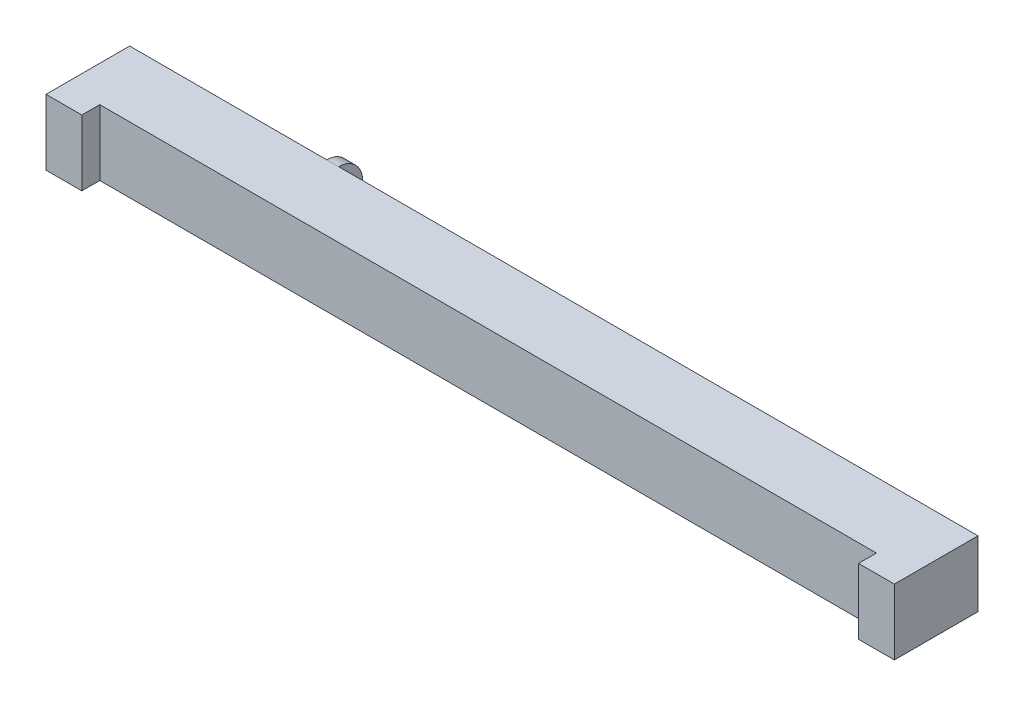
ISO-10303-21;
HEADER;
FILE_DESCRIPTION(('STEP AP214'),'2;1');
FILE_NAME('part.step','',(''),(''),'','','');
FILE_SCHEMA(('AUTOMOTIVE_DESIGN { 1 0 10303 214 1 1 1 1 }'));
ENDSEC;
DATA;
#1=APPLICATION_CONTEXT('core data for automotive mechanical design processes');
#2=APPLICATION_PROTOCOL_DEFINITION('international standard','automotive_design',2000,#1);
#3=PRODUCT_CONTEXT('',#1,'mechanical');
#4=PRODUCT('Part','Part','',(#3));
#5=PRODUCT_RELATED_PRODUCT_CATEGORY('part','',(#4));
#6=PRODUCT_DEFINITION_FORMATION('','',#4);
#7=PRODUCT_DEFINITION_CONTEXT('part definition',#1,'design');
#8=PRODUCT_DEFINITION('design','',#6,#7);
#9=PRODUCT_DEFINITION_SHAPE('','',#8);
#10=(LENGTH_UNIT() NAMED_UNIT(*) SI_UNIT(.MILLI.,.METRE.));
#11=(NAMED_UNIT(*) PLANE_ANGLE_UNIT() SI_UNIT($,.RADIAN.));
#12=(NAMED_UNIT(*) SI_UNIT($,.STERADIAN.) SOLID_ANGLE_UNIT());
#13=UNCERTAINTY_MEASURE_WITH_UNIT(LENGTH_MEASURE(1.E-05),#10,'distance_accuracy_value','');
#14=(GEOMETRIC_REPRESENTATION_CONTEXT(3) GLOBAL_UNCERTAINTY_ASSIGNED_CONTEXT((#13)) GLOBAL_UNIT_ASSIGNED_CONTEXT((#10,
#11,#12)) REPRESENTATION_CONTEXT('',''));
#15=CARTESIAN_POINT('',(0.,0.,0.));
#16=DIRECTION('',(0.,0.,1.));
#17=DIRECTION('',(1.,0.,0.));
#18=AXIS2_PLACEMENT_3D('',#15,#16,#17);
#19=CARTESIAN_POINT('',(-31.5,-63.0317380372777,-3.5));
#20=DIRECTION('',(-1.,0.,0.));
#21=DIRECTION('',(0.,0.,1.));
#22=AXIS2_PLACEMENT_3D('',#19,#20,#21);
#23=PLANE('',#22);
#24=DIRECTION('',(0.,1.,0.));
#25=VECTOR('',#24,1.);
#26=CARTESIAN_POINT('',(-31.5,-63.0317380372777,-3.5));
#27=LINE('',#26,#25);
#28=CARTESIAN_POINT('',(-31.5,0.,-3.5));
#29=VERTEX_POINT('',#28);
#30=CARTESIAN_POINT('',(-31.5,2.6,-3.5));
#31=VERTEX_POINT('',#30);
#32=EDGE_CURVE('E305',#29,#31,#27,.T.);
#33=ORIENTED_EDGE('',*,*,#32,.T.);
#34=DIRECTION('',(0.,0.,1.));
#35=VECTOR('',#34,1.);
#36=CARTESIAN_POINT('',(-31.5,2.6,-5.5));
#37=LINE('',#36,#35);
#38=CARTESIAN_POINT('',(-31.5,2.6,-5.5));
#39=VERTEX_POINT('',#38);
#40=EDGE_CURVE('E257',#39,#31,#37,.T.);
#41=ORIENTED_EDGE('',*,*,#40,.F.);
#42=DIRECTION('',(0.,1.,0.));
#43=VECTOR('',#42,1.);
#44=CARTESIAN_POINT('',(-31.5,-63.0317380372777,-5.5));
#45=LINE('',#44,#43);
#46=CARTESIAN_POINT('',(-31.5,0.,-5.5));
#47=VERTEX_POINT('',#46);
#48=EDGE_CURVE('E428',#47,#39,#45,.T.);
#49=ORIENTED_EDGE('',*,*,#48,.F.);
#50=DIRECTION('',(0.,0.,-1.));
#51=VECTOR('',#50,1.);
#52=CARTESIAN_POINT('',(-31.5,0.,-3.5));
#53=LINE('',#52,#51);
#54=EDGE_CURVE('E304',#29,#47,#53,.T.);
#55=ORIENTED_EDGE('',*,*,#54,.F.);
#56=EDGE_LOOP('',(#33,#41,#49,#55));
#57=FACE_BOUND('',#56,.T.);
#58=ADVANCED_FACE('F35',(#57),#23,.T.);
#59=CARTESIAN_POINT('',(-35.5,5.5,-3.5));
#60=DIRECTION('',(0.,0.,1.));
#61=DIRECTION('',(1.,0.,0.));
#62=AXIS2_PLACEMENT_3D('',#59,#60,#61);
#63=PLANE('',#62);
#64=DIRECTION('',(0.,1.,0.));
#65=VECTOR('',#64,1.);
#66=CARTESIAN_POINT('',(-34.670728733258,4.93410987982223,-3.5));
#67=LINE('',#66,#65);
#68=CARTESIAN_POINT('',(-34.670728733258,3.13346972287778,-3.5));
#69=VERTEX_POINT('',#68);
#70=CARTESIAN_POINT('',(-34.670728733258,4.93410987982223,-3.5));
#71=VERTEX_POINT('',#70);
#72=EDGE_CURVE('E232',#69,#71,#67,.T.);
#73=ORIENTED_EDGE('',*,*,#72,.F.);
#74=DIRECTION('',(-1.,0.,0.));
#75=VECTOR('',#74,1.);
#76=CARTESIAN_POINT('',(-34.670728733258,3.13346972287778,-3.5));
#77=LINE('',#76,#75);
#78=CARTESIAN_POINT('',(-19.,3.13346972287778,-3.5));
#79=VERTEX_POINT('',#78);
#80=EDGE_CURVE('E240',#79,#69,#77,.T.);
#81=ORIENTED_EDGE('',*,*,#80,.F.);
#82=DIRECTION('',(0.,1.,0.));
#83=VECTOR('',#82,1.);
#84=CARTESIAN_POINT('',(-19.,2.6,-3.5));
#85=LINE('',#84,#83);
#86=CARTESIAN_POINT('',(-19.,2.6,-3.5));
#87=VERTEX_POINT('',#86);
#88=EDGE_CURVE('E277',#87,#79,#85,.T.);
#89=ORIENTED_EDGE('',*,*,#88,.F.);
#90=DIRECTION('',(1.,0.,0.));
#91=VECTOR('',#90,1.);
#92=CARTESIAN_POINT('',(-31.5,2.6,-3.5));
#93=LINE('',#92,#91);
#94=EDGE_CURVE('E265',#31,#87,#93,.T.);
#95=ORIENTED_EDGE('',*,*,#94,.F.);
#96=ORIENTED_EDGE('',*,*,#32,.F.);
#97=DIRECTION('',(-1.,0.,0.));
#98=VECTOR('',#97,1.);
#99=CARTESIAN_POINT('',(-35.5,0.,-3.5));
#100=LINE('',#99,#98);
#101=CARTESIAN_POINT('',(-35.5,0.,-3.5));
#102=VERTEX_POINT('',#101);
#103=EDGE_CURVE('E363',#29,#102,#100,.T.);
#104=ORIENTED_EDGE('',*,*,#103,.T.);
#105=DIRECTION('',(0.,-1.,0.));
#106=VECTOR('',#105,1.);
#107=CARTESIAN_POINT('',(-35.5,5.5,-3.5));
#108=LINE('',#107,#106);
#109=CARTESIAN_POINT('',(-35.5,5.5,-3.5));
#110=VERTEX_POINT('',#109);
#111=EDGE_CURVE('E338',#110,#102,#108,.T.);
#112=ORIENTED_EDGE('',*,*,#111,.F.);
#113=DIRECTION('',(-1.,0.,0.));
#114=VECTOR('',#113,1.);
#115=CARTESIAN_POINT('',(-35.5,5.5,-3.5));
#116=LINE('',#115,#114);
#117=CARTESIAN_POINT('',(-19.,5.5,-3.5));
#118=VERTEX_POINT('',#117);
#119=EDGE_CURVE('E329',#118,#110,#116,.T.);
#120=ORIENTED_EDGE('',*,*,#119,.F.);
#121=CARTESIAN_POINT('',(-19.,4.93410987982222,-3.5));
#122=VERTEX_POINT('',#121);
#123=EDGE_CURVE('E272',#122,#118,#85,.T.);
#124=ORIENTED_EDGE('',*,*,#123,.F.);
#125=DIRECTION('',(1.,0.,0.));
#126=VECTOR('',#125,1.);
#127=CARTESIAN_POINT('',(-34.670728733258,4.93410987982223,-3.5));
#128=LINE('',#127,#126);
#129=EDGE_CURVE('E58',#71,#122,#128,.T.);
#130=ORIENTED_EDGE('',*,*,#129,.F.);
#131=EDGE_LOOP('',(#73,#81,#89,#95,#96,#104,#112,#120,#124,#130));
#132=FACE_BOUND('',#131,.T.);
#133=ADVANCED_FACE('F336',(#132),#63,.F.);
#134=CARTESIAN_POINT('',(-35.5,5.5,3.5));
#135=DIRECTION('',(0.,0.,-1.));
#136=DIRECTION('',(-1.,0.,0.));
#137=AXIS2_PLACEMENT_3D('',#134,#135,#136);
#138=PLANE('',#137);
#139=DIRECTION('',(1.,0.,0.));
#140=VECTOR('',#139,1.);
#141=CARTESIAN_POINT('',(-35.5,5.5,3.5));
#142=LINE('',#141,#140);
#143=CARTESIAN_POINT('',(32.5,5.5,3.5));
#144=VERTEX_POINT('',#143);
#145=CARTESIAN_POINT('',(35.5,5.5,3.5));
#146=VERTEX_POINT('',#145);
#147=EDGE_CURVE('E406',#144,#146,#142,.T.);
#148=ORIENTED_EDGE('',*,*,#147,.F.);
#149=DIRECTION('',(0.,-1.,0.));
#150=VECTOR('',#149,1.);
#151=CARTESIAN_POINT('',(32.5,5.5,3.5));
#152=LINE('',#151,#150);
#153=CARTESIAN_POINT('',(32.5,0.,3.5));
#154=VERTEX_POINT('',#153);
#155=EDGE_CURVE('E357',#144,#154,#152,.T.);
#156=ORIENTED_EDGE('',*,*,#155,.T.);
#157=DIRECTION('',(1.,0.,0.));
#158=VECTOR('',#157,1.);
#159=CARTESIAN_POINT('',(-35.5,0.,3.5));
#160=LINE('',#159,#158);
#161=CARTESIAN_POINT('',(35.5,0.,3.5));
#162=VERTEX_POINT('',#161);
#163=EDGE_CURVE('E356',#154,#162,#160,.T.);
#164=ORIENTED_EDGE('',*,*,#163,.T.);
#165=DIRECTION('',(0.,-1.,0.));
#166=VECTOR('',#165,1.);
#167=CARTESIAN_POINT('',(35.5,5.5,3.5));
#168=LINE('',#167,#166);
#169=EDGE_CURVE('E383',#146,#162,#168,.T.);
#170=ORIENTED_EDGE('',*,*,#169,.F.);
#171=EDGE_LOOP('',(#148,#156,#164,#170));
#172=FACE_BOUND('',#171,.T.);
#173=ADVANCED_FACE('F466',(#172),#138,.F.);
#174=CARTESIAN_POINT('',(-35.5,5.5,-3.5));
#175=DIRECTION('',(1.,0.,0.));
#176=DIRECTION('',(0.,0.,-1.));
#177=AXIS2_PLACEMENT_3D('',#174,#175,#176);
#178=PLANE('',#177);
#179=DIRECTION('',(0.,0.,1.));
#180=VECTOR('',#179,1.);
#181=CARTESIAN_POINT('',(-35.5,0.,-3.5));
#182=LINE('',#181,#180);
#183=CARTESIAN_POINT('',(-35.5,0.,3.5));
#184=VERTEX_POINT('',#183);
#185=EDGE_CURVE('E352',#102,#184,#182,.T.);
#186=ORIENTED_EDGE('',*,*,#185,.T.);
#187=DIRECTION('',(0.,-1.,0.));
#188=VECTOR('',#187,1.);
#189=CARTESIAN_POINT('',(-35.5,5.5,3.5));
#190=LINE('',#189,#188);
#191=CARTESIAN_POINT('',(-35.5,5.5,3.5));
#192=VERTEX_POINT('',#191);
#193=EDGE_CURVE('E380',#192,#184,#190,.T.);
#194=ORIENTED_EDGE('',*,*,#193,.F.);
#195=DIRECTION('',(0.,0.,1.));
#196=VECTOR('',#195,1.);
#197=CARTESIAN_POINT('',(-35.5,5.5,-3.5));
#198=LINE('',#197,#196);
#199=EDGE_CURVE('E371',#110,#192,#198,.T.);
#200=ORIENTED_EDGE('',*,*,#199,.F.);
#201=ORIENTED_EDGE('',*,*,#111,.T.);
#202=EDGE_LOOP('',(#186,#194,#200,#201));
#203=FACE_BOUND('',#202,.T.);
#204=ADVANCED_FACE('F392',(#203),#178,.F.);
#205=CARTESIAN_POINT('',(-32.5,0.,3.5));
#206=VERTEX_POINT('',#205);
#207=EDGE_CURVE('E358',#184,#206,#160,.T.);
#208=ORIENTED_EDGE('',*,*,#207,.T.);
#209=DIRECTION('',(0.,1.,0.));
#210=VECTOR('',#209,1.);
#211=CARTESIAN_POINT('',(-32.5,5.5,3.5));
#212=LINE('',#211,#210);
#213=CARTESIAN_POINT('',(-32.5,5.5,3.5));
#214=VERTEX_POINT('',#213);
#215=EDGE_CURVE('E404',#206,#214,#212,.T.);
#216=ORIENTED_EDGE('',*,*,#215,.T.);
#217=EDGE_CURVE('E343',#192,#214,#142,.T.);
#218=ORIENTED_EDGE('',*,*,#217,.F.);
#219=ORIENTED_EDGE('',*,*,#193,.T.);
#220=EDGE_LOOP('',(#208,#216,#218,#219));
#221=FACE_BOUND('',#220,.T.);
#222=ADVANCED_FACE('F402',(#221),#138,.F.);
#223=CARTESIAN_POINT('',(35.5,5.5,-3.5));
#224=DIRECTION('',(-1.,0.,0.));
#225=DIRECTION('',(0.,0.,1.));
#226=AXIS2_PLACEMENT_3D('',#223,#224,#225);
#227=PLANE('',#226);
#228=DIRECTION('',(0.,0.,-1.));
#229=VECTOR('',#228,1.);
#230=CARTESIAN_POINT('',(35.5,0.,-3.5));
#231=LINE('',#230,#229);
#232=CARTESIAN_POINT('',(35.5,0.,-3.5));
#233=VERTEX_POINT('',#232);
#234=EDGE_CURVE('E361',#162,#233,#231,.T.);
#235=ORIENTED_EDGE('',*,*,#234,.T.);
#236=DIRECTION('',(0.,-1.,0.));
#237=VECTOR('',#236,1.);
#238=CARTESIAN_POINT('',(35.5,5.5,-3.5));
#239=LINE('',#238,#237);
#240=CARTESIAN_POINT('',(35.5,5.5,-3.5));
#241=VERTEX_POINT('',#240);
#242=EDGE_CURVE('E385',#241,#233,#239,.T.);
#243=ORIENTED_EDGE('',*,*,#242,.F.);
#244=DIRECTION('',(0.,0.,-1.));
#245=VECTOR('',#244,1.);
#246=CARTESIAN_POINT('',(35.5,5.5,-3.5));
#247=LINE('',#246,#245);
#248=EDGE_CURVE('E340',#146,#241,#247,.T.);
#249=ORIENTED_EDGE('',*,*,#248,.F.);
#250=ORIENTED_EDGE('',*,*,#169,.T.);
#251=EDGE_LOOP('',(#235,#243,#249,#250));
#252=FACE_BOUND('',#251,.T.);
#253=ADVANCED_FACE('F495',(#252),#227,.F.);
#254=DIRECTION('',(0.,1.,0.));
#255=VECTOR('',#254,1.);
#256=CARTESIAN_POINT('',(-18.,2.6,-3.5));
#257=LINE('',#256,#255);
#258=CARTESIAN_POINT('',(-18.,2.6,-3.5));
#259=VERTEX_POINT('',#258);
#260=CARTESIAN_POINT('',(-18.,3.13346972287778,-3.5));
#261=VERTEX_POINT('',#260);
#262=EDGE_CURVE('E290',#259,#261,#257,.T.);
#263=ORIENTED_EDGE('',*,*,#262,.T.);
#264=DIRECTION('',(-1.,0.,0.));
#265=VECTOR('',#264,1.);
#266=CARTESIAN_POINT('',(-18.,3.13346972287778,-3.5));
#267=LINE('',#266,#265);
#268=CARTESIAN_POINT('',(34.747146170088,3.13346972287778,-3.5));
#269=VERTEX_POINT('',#268);
#270=EDGE_CURVE('E50',#269,#261,#267,.T.);
#271=ORIENTED_EDGE('',*,*,#270,.F.);
#272=DIRECTION('',(0.,-1.,0.));
#273=VECTOR('',#272,1.);
#274=CARTESIAN_POINT('',(34.747146170088,4.93410987982223,-3.5));
#275=LINE('',#274,#273);
#276=CARTESIAN_POINT('',(34.747146170088,4.93410987982223,-3.5));
#277=VERTEX_POINT('',#276);
#278=EDGE_CURVE('E221',#277,#269,#275,.T.);
#279=ORIENTED_EDGE('',*,*,#278,.F.);
#280=DIRECTION('',(1.,0.,0.));
#281=VECTOR('',#280,1.);
#282=CARTESIAN_POINT('',(-18.,4.93410987982223,-3.5));
#283=LINE('',#282,#281);
#284=CARTESIAN_POINT('',(-18.,4.93410987982223,-3.5));
#285=VERTEX_POINT('',#284);
#286=EDGE_CURVE('E226',#285,#277,#283,.T.);
#287=ORIENTED_EDGE('',*,*,#286,.F.);
#288=CARTESIAN_POINT('',(-18.,5.5,-3.5));
#289=VERTEX_POINT('',#288);
#290=EDGE_CURVE('E203',#285,#289,#257,.T.);
#291=ORIENTED_EDGE('',*,*,#290,.T.);
#292=EDGE_CURVE('E332',#241,#289,#116,.T.);
#293=ORIENTED_EDGE('',*,*,#292,.F.);
#294=ORIENTED_EDGE('',*,*,#242,.T.);
#295=CARTESIAN_POINT('',(31.5,0.,-3.5));
#296=VERTEX_POINT('',#295);
#297=EDGE_CURVE('E369',#233,#296,#100,.T.);
#298=ORIENTED_EDGE('',*,*,#297,.T.);
#299=DIRECTION('',(0.,1.,0.));
#300=VECTOR('',#299,1.);
#301=CARTESIAN_POINT('',(31.5,-63.0317380372777,-3.5));
#302=LINE('',#301,#300);
#303=CARTESIAN_POINT('',(31.5,2.6,-3.5));
#304=VERTEX_POINT('',#303);
#305=EDGE_CURVE('E300',#296,#304,#302,.T.);
#306=ORIENTED_EDGE('',*,*,#305,.T.);
#307=DIRECTION('',(1.,0.,0.));
#308=VECTOR('',#307,1.);
#309=CARTESIAN_POINT('',(31.5,2.6,-3.5));
#310=LINE('',#309,#308);
#311=EDGE_CURVE('E287',#259,#304,#310,.T.);
#312=ORIENTED_EDGE('',*,*,#311,.F.);
#313=EDGE_LOOP('',(#263,#271,#279,#287,#291,#293,#294,#298,#306,#312));
#314=FACE_BOUND('',#313,.T.);
#315=ADVANCED_FACE('F468',(#314),#63,.F.);
#316=CARTESIAN_POINT('',(-35.5,5.5,3.5));
#317=DIRECTION('',(0.,1.,0.));
#318=DIRECTION('',(0.,0.,1.));
#319=AXIS2_PLACEMENT_3D('',#316,#317,#318);
#320=PLANE('',#319);
#321=ORIENTED_EDGE('',*,*,#292,.T.);
#322=DIRECTION('',(-1.,0.,0.));
#323=VECTOR('',#322,1.);
#324=CARTESIAN_POINT('',(-35.5,5.5,-3.5));
#325=LINE('',#324,#323);
#326=EDGE_CURVE('E308',#289,#118,#325,.T.);
#327=ORIENTED_EDGE('',*,*,#326,.T.);
#328=ORIENTED_EDGE('',*,*,#119,.T.);
#329=ORIENTED_EDGE('',*,*,#199,.T.);
#330=ORIENTED_EDGE('',*,*,#217,.T.);
#331=DIRECTION('',(0.,0.,1.));
#332=VECTOR('',#331,1.);
#333=CARTESIAN_POINT('',(-32.5,5.5,4.76632018269155));
#334=LINE('',#333,#332);
#335=CARTESIAN_POINT('',(-32.5,5.5,2.));
#336=VERTEX_POINT('',#335);
#337=EDGE_CURVE('E416',#336,#214,#334,.T.);
#338=ORIENTED_EDGE('',*,*,#337,.F.);
#339=DIRECTION('',(-1.,0.,0.));
#340=VECTOR('',#339,1.);
#341=CARTESIAN_POINT('',(32.5,5.5,2.));
#342=LINE('',#341,#340);
#343=CARTESIAN_POINT('',(32.5,5.5,2.));
#344=VERTEX_POINT('',#343);
#345=EDGE_CURVE('E419',#344,#336,#342,.T.);
#346=ORIENTED_EDGE('',*,*,#345,.F.);
#347=DIRECTION('',(0.,0.,-1.));
#348=VECTOR('',#347,1.);
#349=CARTESIAN_POINT('',(32.5,5.5,4.76632018269155));
#350=LINE('',#349,#348);
#351=EDGE_CURVE('E422',#144,#344,#350,.T.);
#352=ORIENTED_EDGE('',*,*,#351,.F.);
#353=ORIENTED_EDGE('',*,*,#147,.T.);
#354=ORIENTED_EDGE('',*,*,#248,.T.);
#355=EDGE_LOOP('',(#321,#327,#328,#329,#330,#338,#346,#352,#353,#354));
#356=FACE_BOUND('',#355,.T.);
#357=ADVANCED_FACE('F327',(#356),#320,.T.);
#358=CARTESIAN_POINT('',(-35.5,0.,3.5));
#359=DIRECTION('',(0.,1.,0.));
#360=DIRECTION('',(0.,0.,1.));
#361=AXIS2_PLACEMENT_3D('',#358,#359,#360);
#362=PLANE('',#361);
#363=ORIENTED_EDGE('',*,*,#163,.F.);
#364=DIRECTION('',(0.,0.,-1.));
#365=VECTOR('',#364,1.);
#366=CARTESIAN_POINT('',(32.5,0.,3.5));
#367=LINE('',#366,#365);
#368=CARTESIAN_POINT('',(32.5,0.,2.));
#369=VERTEX_POINT('',#368);
#370=EDGE_CURVE('E312',#154,#369,#367,.T.);
#371=ORIENTED_EDGE('',*,*,#370,.T.);
#372=DIRECTION('',(-1.,0.,0.));
#373=VECTOR('',#372,1.);
#374=CARTESIAN_POINT('',(-35.5,0.,2.));
#375=LINE('',#374,#373);
#376=CARTESIAN_POINT('',(-32.5,0.,2.));
#377=VERTEX_POINT('',#376);
#378=EDGE_CURVE('E377',#369,#377,#375,.T.);
#379=ORIENTED_EDGE('',*,*,#378,.T.);
#380=DIRECTION('',(0.,0.,1.));
#381=VECTOR('',#380,1.);
#382=CARTESIAN_POINT('',(-32.5,0.,3.5));
#383=LINE('',#382,#381);
#384=EDGE_CURVE('E374',#377,#206,#383,.T.);
#385=ORIENTED_EDGE('',*,*,#384,.T.);
#386=ORIENTED_EDGE('',*,*,#207,.F.);
#387=ORIENTED_EDGE('',*,*,#185,.F.);
#388=ORIENTED_EDGE('',*,*,#103,.F.);
#389=ORIENTED_EDGE('',*,*,#54,.T.);
#390=DIRECTION('',(1.,0.,0.));
#391=VECTOR('',#390,1.);
#392=CARTESIAN_POINT('',(31.5,0.,-5.5));
#393=LINE('',#392,#391);
#394=CARTESIAN_POINT('',(31.5,0.,-5.5));
#395=VERTEX_POINT('',#394);
#396=EDGE_CURVE('E424',#47,#395,#393,.T.);
#397=ORIENTED_EDGE('',*,*,#396,.T.);
#398=DIRECTION('',(0.,0.,1.));
#399=VECTOR('',#398,1.);
#400=CARTESIAN_POINT('',(31.5,0.,-3.5));
#401=LINE('',#400,#399);
#402=EDGE_CURVE('E426',#395,#296,#401,.T.);
#403=ORIENTED_EDGE('',*,*,#402,.T.);
#404=ORIENTED_EDGE('',*,*,#297,.F.);
#405=ORIENTED_EDGE('',*,*,#234,.F.);
#406=EDGE_LOOP('',(#363,#371,#379,#385,#386,#387,#388,#389,#397,#403,#404,#405));
#407=FACE_BOUND('',#406,.T.);
#408=ADVANCED_FACE('F397',(#407),#362,.F.);
#409=CARTESIAN_POINT('',(32.5,-2.,4.76632018269155));
#410=DIRECTION('',(1.,0.,0.));
#411=DIRECTION('',(0.,0.,-1.));
#412=AXIS2_PLACEMENT_3D('',#409,#410,#411);
#413=PLANE('',#412);
#414=ORIENTED_EDGE('',*,*,#351,.T.);
#415=DIRECTION('',(0.,1.,0.));
#416=VECTOR('',#415,1.);
#417=CARTESIAN_POINT('',(32.5,-2.,2.));
#418=LINE('',#417,#416);
#419=EDGE_CURVE('E413',#369,#344,#418,.T.);
#420=ORIENTED_EDGE('',*,*,#419,.F.);
#421=ORIENTED_EDGE('',*,*,#370,.F.);
#422=ORIENTED_EDGE('',*,*,#155,.F.);
#423=EDGE_LOOP('',(#414,#420,#421,#422));
#424=FACE_BOUND('',#423,.T.);
#425=ADVANCED_FACE('F482',(#424),#413,.F.);
#426=CARTESIAN_POINT('',(-32.5,-2.,4.76632018269155));
#427=DIRECTION('',(-1.,0.,0.));
#428=DIRECTION('',(0.,0.,1.));
#429=AXIS2_PLACEMENT_3D('',#426,#427,#428);
#430=PLANE('',#429);
#431=ORIENTED_EDGE('',*,*,#384,.F.);
#432=DIRECTION('',(0.,1.,0.));
#433=VECTOR('',#432,1.);
#434=CARTESIAN_POINT('',(-32.5,-2.,2.));
#435=LINE('',#434,#433);
#436=EDGE_CURVE('E412',#377,#336,#435,.T.);
#437=ORIENTED_EDGE('',*,*,#436,.T.);
#438=ORIENTED_EDGE('',*,*,#337,.T.);
#439=ORIENTED_EDGE('',*,*,#215,.F.);
#440=EDGE_LOOP('',(#431,#437,#438,#439));
#441=FACE_BOUND('',#440,.T.);
#442=ADVANCED_FACE('F479',(#441),#430,.F.);
#443=CARTESIAN_POINT('',(32.5,-2.,2.));
#444=DIRECTION('',(0.,0.,-1.));
#445=DIRECTION('',(-1.,0.,0.));
#446=AXIS2_PLACEMENT_3D('',#443,#444,#445);
#447=PLANE('',#446);
#448=ORIENTED_EDGE('',*,*,#419,.T.);
#449=ORIENTED_EDGE('',*,*,#345,.T.);
#450=ORIENTED_EDGE('',*,*,#436,.F.);
#451=ORIENTED_EDGE('',*,*,#378,.F.);
#452=EDGE_LOOP('',(#448,#449,#450,#451));
#453=FACE_BOUND('',#452,.T.);
#454=ADVANCED_FACE('F477',(#453),#447,.F.);
#455=CARTESIAN_POINT('',(31.5,-63.0317380372777,-3.5));
#456=DIRECTION('',(1.,0.,0.));
#457=DIRECTION('',(0.,0.,-1.));
#458=AXIS2_PLACEMENT_3D('',#455,#456,#457);
#459=PLANE('',#458);
#460=DIRECTION('',(0.,0.,-1.));
#461=VECTOR('',#460,1.);
#462=CARTESIAN_POINT('',(31.5,2.6,-5.5));
#463=LINE('',#462,#461);
#464=CARTESIAN_POINT('',(31.5,2.6,-5.5));
#465=VERTEX_POINT('',#464);
#466=EDGE_CURVE('E276',#304,#465,#463,.T.);
#467=ORIENTED_EDGE('',*,*,#466,.F.);
#468=ORIENTED_EDGE('',*,*,#305,.F.);
#469=ORIENTED_EDGE('',*,*,#402,.F.);
#470=DIRECTION('',(0.,1.,0.));
#471=VECTOR('',#470,1.);
#472=CARTESIAN_POINT('',(31.5,-63.0317380372777,-5.5));
#473=LINE('',#472,#471);
#474=EDGE_CURVE('E293',#395,#465,#473,.T.);
#475=ORIENTED_EDGE('',*,*,#474,.T.);
#476=EDGE_LOOP('',(#467,#468,#469,#475));
#477=FACE_BOUND('',#476,.T.);
#478=ADVANCED_FACE('F474',(#477),#459,.T.);
#479=CARTESIAN_POINT('',(31.5,-63.0317380372777,-5.5));
#480=DIRECTION('',(0.,0.,-1.));
#481=DIRECTION('',(-1.,0.,0.));
#482=AXIS2_PLACEMENT_3D('',#479,#480,#481);
#483=PLANE('',#482);
#484=DIRECTION('',(0.,1.,0.));
#485=VECTOR('',#484,1.);
#486=CARTESIAN_POINT('',(-19.,2.6,-5.5));
#487=LINE('',#486,#485);
#488=CARTESIAN_POINT('',(-19.,2.6,-5.5));
#489=VERTEX_POINT('',#488);
#490=CARTESIAN_POINT('',(-19.,3.5,-5.5));
#491=VERTEX_POINT('',#490);
#492=EDGE_CURVE('E273',#489,#491,#487,.T.);
#493=ORIENTED_EDGE('',*,*,#492,.T.);
#494=DIRECTION('',(-1.,0.,0.));
#495=VECTOR('',#494,1.);
#496=CARTESIAN_POINT('',(31.5,3.5,-5.5));
#497=LINE('',#496,#495);
#498=CARTESIAN_POINT('',(-18.,3.5,-5.5));
#499=VERTEX_POINT('',#498);
#500=EDGE_CURVE('E43',#491,#499,#497,.F.);
#501=ORIENTED_EDGE('',*,*,#500,.T.);
#502=DIRECTION('',(0.,1.,0.));
#503=VECTOR('',#502,1.);
#504=CARTESIAN_POINT('',(-18.,2.6,-5.5));
#505=LINE('',#504,#503);
#506=CARTESIAN_POINT('',(-18.,2.6,-5.5));
#507=VERTEX_POINT('',#506);
#508=EDGE_CURVE('E289',#507,#499,#505,.T.);
#509=ORIENTED_EDGE('',*,*,#508,.F.);
#510=DIRECTION('',(-1.,0.,0.));
#511=VECTOR('',#510,1.);
#512=CARTESIAN_POINT('',(31.5,2.6,-5.5));
#513=LINE('',#512,#511);
#514=EDGE_CURVE('E281',#465,#507,#513,.T.);
#515=ORIENTED_EDGE('',*,*,#514,.F.);
#516=ORIENTED_EDGE('',*,*,#474,.F.);
#517=ORIENTED_EDGE('',*,*,#396,.F.);
#518=ORIENTED_EDGE('',*,*,#48,.T.);
#519=DIRECTION('',(-1.,0.,0.));
#520=VECTOR('',#519,1.);
#521=CARTESIAN_POINT('',(-31.5,2.6,-5.5));
#522=LINE('',#521,#520);
#523=EDGE_CURVE('E270',#489,#39,#522,.T.);
#524=ORIENTED_EDGE('',*,*,#523,.F.);
#525=EDGE_LOOP('',(#493,#501,#509,#515,#516,#517,#518,#524));
#526=FACE_BOUND('',#525,.T.);
#527=ADVANCED_FACE('F316',(#526),#483,.T.);
#528=CARTESIAN_POINT('',(-18.,2.6,-5.5));
#529=DIRECTION('',(-1.,0.,0.));
#530=DIRECTION('',(0.,0.,1.));
#531=AXIS2_PLACEMENT_3D('',#528,#529,#530);
#532=PLANE('',#531);
#533=ORIENTED_EDGE('',*,*,#508,.T.);
#534=CARTESIAN_POINT('',(-18.,3.5,-3.5));
#535=DIRECTION('',(-1.,0.,0.));
#536=DIRECTION('',(0.,0.,1.));
#537=AXIS2_PLACEMENT_3D('',#534,#535,#536);
#538=CIRCLE('',#537,2.);
#539=EDGE_CURVE('E11',#499,#289,#538,.F.);
#540=ORIENTED_EDGE('',*,*,#539,.T.);
#541=ORIENTED_EDGE('',*,*,#290,.F.);
#542=DIRECTION('',(0.,0.,-1.));
#543=VECTOR('',#542,1.);
#544=CARTESIAN_POINT('',(-18.,4.93410987982223,-0.6));
#545=LINE('',#544,#543);
#546=CARTESIAN_POINT('',(-18.,4.93410987982223,-0.6));
#547=VERTEX_POINT('',#546);
#548=EDGE_CURVE('E196',#547,#285,#545,.T.);
#549=ORIENTED_EDGE('',*,*,#548,.F.);
#550=DIRECTION('',(0.,1.,0.));
#551=VECTOR('',#550,1.);
#552=CARTESIAN_POINT('',(-18.,4.93410987982223,-0.6));
#553=LINE('',#552,#551);
#554=CARTESIAN_POINT('',(-18.,3.13346972287778,-0.6));
#555=VERTEX_POINT('',#554);
#556=EDGE_CURVE('E201',#555,#547,#553,.T.);
#557=ORIENTED_EDGE('',*,*,#556,.F.);
#558=DIRECTION('',(0.,0.,-1.));
#559=VECTOR('',#558,1.);
#560=CARTESIAN_POINT('',(-18.,3.13346972287778,-0.6));
#561=LINE('',#560,#559);
#562=EDGE_CURVE('E230',#555,#261,#561,.T.);
#563=ORIENTED_EDGE('',*,*,#562,.T.);
#564=ORIENTED_EDGE('',*,*,#262,.F.);
#565=DIRECTION('',(0.,0.,1.));
#566=VECTOR('',#565,1.);
#567=CARTESIAN_POINT('',(-18.,2.6,-5.5));
#568=LINE('',#567,#566);
#569=EDGE_CURVE('E284',#507,#259,#568,.T.);
#570=ORIENTED_EDGE('',*,*,#569,.F.);
#571=EDGE_LOOP('',(#533,#540,#541,#549,#557,#563,#564,#570));
#572=FACE_BOUND('',#571,.T.);
#573=ADVANCED_FACE('F199',(#572),#532,.F.);
#574=CARTESIAN_POINT('',(31.5,2.6,-3.5));
#575=DIRECTION('',(0.,-1.,0.));
#576=DIRECTION('',(0.,0.,-1.));
#577=AXIS2_PLACEMENT_3D('',#574,#575,#576);
#578=PLANE('',#577);
#579=ORIENTED_EDGE('',*,*,#466,.T.);
#580=ORIENTED_EDGE('',*,*,#514,.T.);
#581=ORIENTED_EDGE('',*,*,#569,.T.);
#582=ORIENTED_EDGE('',*,*,#311,.T.);
#583=EDGE_LOOP('',(#579,#580,#581,#582));
#584=FACE_BOUND('',#583,.T.);
#585=ADVANCED_FACE('F522',(#584),#578,.F.);
#586=CARTESIAN_POINT('',(-19.,2.6,-5.5));
#587=DIRECTION('',(1.,0.,0.));
#588=DIRECTION('',(0.,0.,-1.));
#589=AXIS2_PLACEMENT_3D('',#586,#587,#588);
#590=PLANE('',#589);
#591=ORIENTED_EDGE('',*,*,#88,.T.);
#592=DIRECTION('',(0.,0.,-1.));
#593=VECTOR('',#592,1.);
#594=CARTESIAN_POINT('',(-19.,3.13346972287778,-0.6));
#595=LINE('',#594,#593);
#596=CARTESIAN_POINT('',(-19.,3.13346972287778,-0.6));
#597=VERTEX_POINT('',#596);
#598=EDGE_CURVE('E258',#597,#79,#595,.T.);
#599=ORIENTED_EDGE('',*,*,#598,.F.);
#600=DIRECTION('',(0.,-1.,0.));
#601=VECTOR('',#600,1.);
#602=CARTESIAN_POINT('',(-19.,4.93410987982223,-0.6));
#603=LINE('',#602,#601);
#604=CARTESIAN_POINT('',(-19.,4.93410987982223,-0.6));
#605=VERTEX_POINT('',#604);
#606=EDGE_CURVE('E243',#605,#597,#603,.T.);
#607=ORIENTED_EDGE('',*,*,#606,.F.);
#608=DIRECTION('',(0.,0.,-1.));
#609=VECTOR('',#608,1.);
#610=CARTESIAN_POINT('',(-19.,4.93410987982223,-0.6));
#611=LINE('',#610,#609);
#612=EDGE_CURVE('E260',#605,#122,#611,.T.);
#613=ORIENTED_EDGE('',*,*,#612,.T.);
#614=ORIENTED_EDGE('',*,*,#123,.T.);
#615=CARTESIAN_POINT('',(-19.,3.5,-3.5));
#616=DIRECTION('',(1.,0.,0.));
#617=DIRECTION('',(0.,0.,-1.));
#618=AXIS2_PLACEMENT_3D('',#615,#616,#617);
#619=CIRCLE('',#618,2.);
#620=EDGE_CURVE('E311',#118,#491,#619,.F.);
#621=ORIENTED_EDGE('',*,*,#620,.T.);
#622=ORIENTED_EDGE('',*,*,#492,.F.);
#623=DIRECTION('',(0.,0.,-1.));
#624=VECTOR('',#623,1.);
#625=CARTESIAN_POINT('',(-19.,2.6,-5.5));
#626=LINE('',#625,#624);
#627=EDGE_CURVE('E268',#87,#489,#626,.T.);
#628=ORIENTED_EDGE('',*,*,#627,.F.);
#629=EDGE_LOOP('',(#591,#599,#607,#613,#614,#621,#622,#628));
#630=FACE_BOUND('',#629,.T.);
#631=ADVANCED_FACE('F440',(#630),#590,.F.);
#632=CARTESIAN_POINT('',(-31.5,2.6,-5.5));
#633=DIRECTION('',(0.,1.,0.));
#634=DIRECTION('',(0.,0.,1.));
#635=AXIS2_PLACEMENT_3D('',#632,#633,#634);
#636=PLANE('',#635);
#637=ORIENTED_EDGE('',*,*,#40,.T.);
#638=ORIENTED_EDGE('',*,*,#94,.T.);
#639=ORIENTED_EDGE('',*,*,#627,.T.);
#640=ORIENTED_EDGE('',*,*,#523,.T.);
#641=EDGE_LOOP('',(#637,#638,#639,#640));
#642=FACE_BOUND('',#641,.T.);
#643=ADVANCED_FACE('F438',(#642),#636,.T.);
#644=CARTESIAN_POINT('',(-35.5,3.5,-3.5));
#645=DIRECTION('',(-1.,0.,0.));
#646=DIRECTION('',(0.,0.,1.));
#647=AXIS2_PLACEMENT_3D('',#644,#645,#646);
#648=CYLINDRICAL_SURFACE('',#647,2.);
#649=ORIENTED_EDGE('',*,*,#539,.F.);
#650=ORIENTED_EDGE('',*,*,#500,.F.);
#651=ORIENTED_EDGE('',*,*,#620,.F.);
#652=ORIENTED_EDGE('',*,*,#326,.F.);
#653=EDGE_LOOP('',(#649,#650,#651,#652));
#654=FACE_BOUND('',#653,.T.);
#655=ADVANCED_FACE('F37',(#654),#648,.T.);
#656=CARTESIAN_POINT('',(-34.670728733258,4.93410987982223,-0.6));
#657=DIRECTION('',(-1.,0.,0.));
#658=DIRECTION('',(0.,0.,1.));
#659=AXIS2_PLACEMENT_3D('',#656,#657,#658);
#660=PLANE('',#659);
#661=ORIENTED_EDGE('',*,*,#72,.T.);
#662=DIRECTION('',(0.,0.,-1.));
#663=VECTOR('',#662,1.);
#664=CARTESIAN_POINT('',(-34.670728733258,4.93410987982223,-0.6));
#665=LINE('',#664,#663);
#666=CARTESIAN_POINT('',(-34.670728733258,4.93410987982223,-0.6));
#667=VERTEX_POINT('',#666);
#668=EDGE_CURVE('E249',#667,#71,#665,.T.);
#669=ORIENTED_EDGE('',*,*,#668,.F.);
#670=DIRECTION('',(0.,1.,0.));
#671=VECTOR('',#670,1.);
#672=CARTESIAN_POINT('',(-34.670728733258,4.93410987982223,-0.6));
#673=LINE('',#672,#671);
#674=CARTESIAN_POINT('',(-34.670728733258,3.13346972287778,-0.6));
#675=VERTEX_POINT('',#674);
#676=EDGE_CURVE('E236',#675,#667,#673,.T.);
#677=ORIENTED_EDGE('',*,*,#676,.F.);
#678=DIRECTION('',(0.,0.,-1.));
#679=VECTOR('',#678,1.);
#680=CARTESIAN_POINT('',(-34.670728733258,3.13346972287778,-0.6));
#681=LINE('',#680,#679);
#682=EDGE_CURVE('E255',#675,#69,#681,.T.);
#683=ORIENTED_EDGE('',*,*,#682,.T.);
#684=EDGE_LOOP('',(#661,#669,#677,#683));
#685=FACE_BOUND('',#684,.T.);
#686=ADVANCED_FACE('F449',(#685),#660,.F.);
#687=CARTESIAN_POINT('',(-34.670728733258,3.13346972287778,-0.6));
#688=DIRECTION('',(0.,-1.,0.));
#689=DIRECTION('',(1.,0.,0.));
#690=AXIS2_PLACEMENT_3D('',#687,#688,#689);
#691=PLANE('',#690);
#692=ORIENTED_EDGE('',*,*,#80,.T.);
#693=ORIENTED_EDGE('',*,*,#682,.F.);
#694=DIRECTION('',(-1.,0.,0.));
#695=VECTOR('',#694,1.);
#696=CARTESIAN_POINT('',(-34.670728733258,3.13346972287778,-0.6));
#697=LINE('',#696,#695);
#698=EDGE_CURVE('E246',#597,#675,#697,.T.);
#699=ORIENTED_EDGE('',*,*,#698,.F.);
#700=ORIENTED_EDGE('',*,*,#598,.T.);
#701=EDGE_LOOP('',(#692,#693,#699,#700));
#702=FACE_BOUND('',#701,.T.);
#703=ADVANCED_FACE('F451',(#702),#691,.F.);
#704=CARTESIAN_POINT('',(-34.670728733258,4.93410987982223,-0.6));
#705=DIRECTION('',(0.,1.,0.));
#706=DIRECTION('',(0.,0.,1.));
#707=AXIS2_PLACEMENT_3D('',#704,#705,#706);
#708=PLANE('',#707);
#709=ORIENTED_EDGE('',*,*,#129,.T.);
#710=ORIENTED_EDGE('',*,*,#612,.F.);
#711=DIRECTION('',(1.,0.,0.));
#712=VECTOR('',#711,1.);
#713=CARTESIAN_POINT('',(-34.670728733258,4.93410987982223,-0.6));
#714=LINE('',#713,#712);
#715=EDGE_CURVE('E239',#667,#605,#714,.T.);
#716=ORIENTED_EDGE('',*,*,#715,.F.);
#717=ORIENTED_EDGE('',*,*,#668,.T.);
#718=EDGE_LOOP('',(#709,#710,#716,#717));
#719=FACE_BOUND('',#718,.T.);
#720=ADVANCED_FACE('F443',(#719),#708,.F.);
#721=CARTESIAN_POINT('',(-34.670728733258,4.93410987982223,-0.6));
#722=DIRECTION('',(0.,0.,1.));
#723=DIRECTION('',(1.,0.,0.));
#724=AXIS2_PLACEMENT_3D('',#721,#722,#723);
#725=PLANE('',#724);
#726=ORIENTED_EDGE('',*,*,#676,.T.);
#727=ORIENTED_EDGE('',*,*,#715,.T.);
#728=ORIENTED_EDGE('',*,*,#606,.T.);
#729=ORIENTED_EDGE('',*,*,#698,.T.);
#730=EDGE_LOOP('',(#726,#727,#728,#729));
#731=FACE_BOUND('',#730,.T.);
#732=ADVANCED_FACE('F446',(#731),#725,.F.);
#733=CARTESIAN_POINT('',(-18.,3.13346972287778,-0.6));
#734=DIRECTION('',(0.,-1.,0.));
#735=DIRECTION('',(0.,0.,-1.));
#736=AXIS2_PLACEMENT_3D('',#733,#734,#735);
#737=PLANE('',#736);
#738=ORIENTED_EDGE('',*,*,#270,.T.);
#739=ORIENTED_EDGE('',*,*,#562,.F.);
#740=DIRECTION('',(-1.,0.,0.));
#741=VECTOR('',#740,1.);
#742=CARTESIAN_POINT('',(-18.,3.13346972287778,-0.6));
#743=LINE('',#742,#741);
#744=CARTESIAN_POINT('',(34.747146170088,3.13346972287778,-0.6));
#745=VERTEX_POINT('',#744);
#746=EDGE_CURVE('E208',#745,#555,#743,.T.);
#747=ORIENTED_EDGE('',*,*,#746,.F.);
#748=DIRECTION('',(0.,0.,-1.));
#749=VECTOR('',#748,1.);
#750=CARTESIAN_POINT('',(34.747146170088,3.13346972287778,-0.6));
#751=LINE('',#750,#749);
#752=EDGE_CURVE('E233',#745,#269,#751,.T.);
#753=ORIENTED_EDGE('',*,*,#752,.T.);
#754=EDGE_LOOP('',(#738,#739,#747,#753));
#755=FACE_BOUND('',#754,.T.);
#756=ADVANCED_FACE('F517',(#755),#737,.F.);
#757=CARTESIAN_POINT('',(34.747146170088,4.93410987982223,-0.6));
#758=DIRECTION('',(1.,0.,0.));
#759=DIRECTION('',(0.,0.,-1.));
#760=AXIS2_PLACEMENT_3D('',#757,#758,#759);
#761=PLANE('',#760);
#762=ORIENTED_EDGE('',*,*,#278,.T.);
#763=ORIENTED_EDGE('',*,*,#752,.F.);
#764=DIRECTION('',(0.,-1.,0.));
#765=VECTOR('',#764,1.);
#766=CARTESIAN_POINT('',(34.747146170088,4.93410987982223,-0.6));
#767=LINE('',#766,#765);
#768=CARTESIAN_POINT('',(34.747146170088,4.93410987982223,-0.6));
#769=VERTEX_POINT('',#768);
#770=EDGE_CURVE('E216',#769,#745,#767,.T.);
#771=ORIENTED_EDGE('',*,*,#770,.F.);
#772=DIRECTION('',(0.,0.,-1.));
#773=VECTOR('',#772,1.);
#774=CARTESIAN_POINT('',(34.747146170088,4.93410987982223,-0.6));
#775=LINE('',#774,#773);
#776=EDGE_CURVE('E207',#769,#277,#775,.T.);
#777=ORIENTED_EDGE('',*,*,#776,.T.);
#778=EDGE_LOOP('',(#762,#763,#771,#777));
#779=FACE_BOUND('',#778,.T.);
#780=ADVANCED_FACE('F516',(#779),#761,.F.);
#781=CARTESIAN_POINT('',(-18.,4.93410987982223,-0.6));
#782=DIRECTION('',(0.,1.,0.));
#783=DIRECTION('',(-1.,0.,0.));
#784=AXIS2_PLACEMENT_3D('',#781,#782,#783);
#785=PLANE('',#784);
#786=ORIENTED_EDGE('',*,*,#286,.T.);
#787=ORIENTED_EDGE('',*,*,#776,.F.);
#788=DIRECTION('',(1.,0.,0.));
#789=VECTOR('',#788,1.);
#790=CARTESIAN_POINT('',(-18.,4.93410987982223,-0.6));
#791=LINE('',#790,#789);
#792=EDGE_CURVE('E211',#547,#769,#791,.T.);
#793=ORIENTED_EDGE('',*,*,#792,.F.);
#794=ORIENTED_EDGE('',*,*,#548,.T.);
#795=EDGE_LOOP('',(#786,#787,#793,#794));
#796=FACE_BOUND('',#795,.T.);
#797=ADVANCED_FACE('F212',(#796),#785,.F.);
#798=CARTESIAN_POINT('',(-18.,3.13346972287778,-0.6));
#799=DIRECTION('',(0.,0.,1.));
#800=DIRECTION('',(1.,0.,0.));
#801=AXIS2_PLACEMENT_3D('',#798,#799,#800);
#802=PLANE('',#801);
#803=ORIENTED_EDGE('',*,*,#556,.T.);
#804=ORIENTED_EDGE('',*,*,#792,.T.);
#805=ORIENTED_EDGE('',*,*,#770,.T.);
#806=ORIENTED_EDGE('',*,*,#746,.T.);
#807=EDGE_LOOP('',(#803,#804,#805,#806));
#808=FACE_BOUND('',#807,.T.);
#809=ADVANCED_FACE('F218',(#808),#802,.F.);
#810=CLOSED_SHELL('',(#58,#133,#173,#204,#222,#253,#315,#357,#408,#425,#442,#454,#478,#527,#573,
#585,#631,#643,#655,#686,#703,#720,#732,#756,#780,#797,#809));
#811=MANIFOLD_SOLID_BREP('B2',#810);
#812=ADVANCED_BREP_SHAPE_REPRESENTATION('',(#18,#811),#14);
#813=SHAPE_DEFINITION_REPRESENTATION(#9,#812);
ENDSEC;
END-ISO-10303-21;
